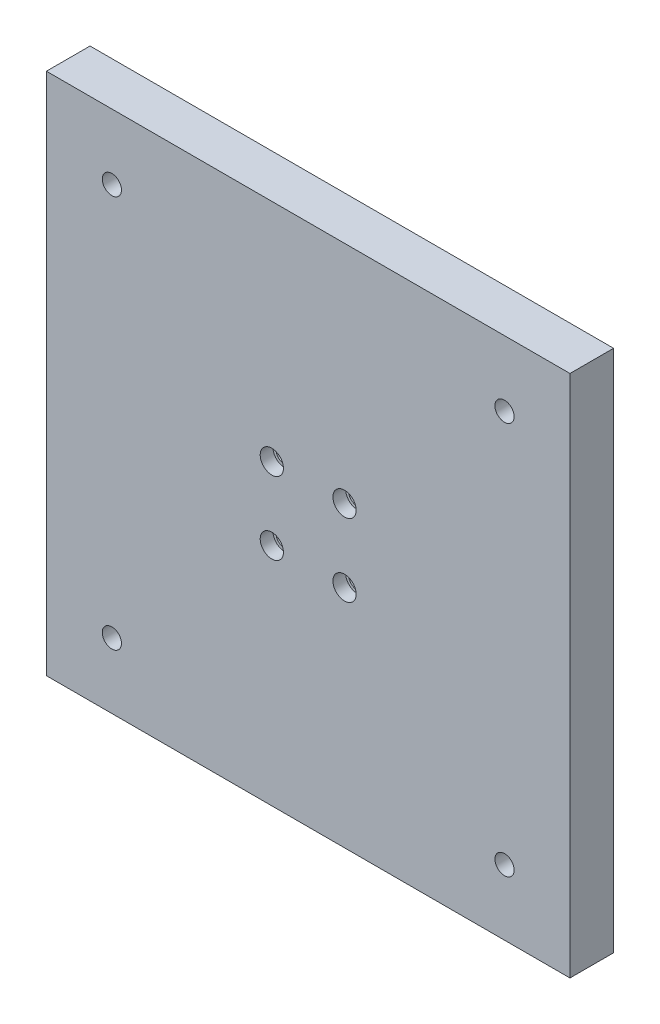
ISO-10303-21;
HEADER;
FILE_DESCRIPTION(('STEP AP214'),'2;1');
FILE_NAME('part.step','',(''),(''),'','','');
FILE_SCHEMA(('AUTOMOTIVE_DESIGN { 1 0 10303 214 1 1 1 1 }'));
ENDSEC;
DATA;
#1=APPLICATION_CONTEXT('core data for automotive mechanical design processes');
#2=APPLICATION_PROTOCOL_DEFINITION('international standard','automotive_design',2000,#1);
#3=PRODUCT_CONTEXT('',#1,'mechanical');
#4=PRODUCT('Part','Part','',(#3));
#5=PRODUCT_RELATED_PRODUCT_CATEGORY('part','',(#4));
#6=PRODUCT_DEFINITION_FORMATION('','',#4);
#7=PRODUCT_DEFINITION_CONTEXT('part definition',#1,'design');
#8=PRODUCT_DEFINITION('design','',#6,#7);
#9=PRODUCT_DEFINITION_SHAPE('','',#8);
#10=(LENGTH_UNIT() NAMED_UNIT(*) SI_UNIT(.MILLI.,.METRE.));
#11=(NAMED_UNIT(*) PLANE_ANGLE_UNIT() SI_UNIT($,.RADIAN.));
#12=(NAMED_UNIT(*) SI_UNIT($,.STERADIAN.) SOLID_ANGLE_UNIT());
#13=UNCERTAINTY_MEASURE_WITH_UNIT(LENGTH_MEASURE(1.E-05),#10,'distance_accuracy_value','');
#14=(GEOMETRIC_REPRESENTATION_CONTEXT(3) GLOBAL_UNCERTAINTY_ASSIGNED_CONTEXT((#13)) GLOBAL_UNIT_ASSIGNED_CONTEXT((#10,
#11,#12)) REPRESENTATION_CONTEXT('',''));
#15=CARTESIAN_POINT('',(0.,0.,0.));
#16=DIRECTION('',(0.,0.,1.));
#17=DIRECTION('',(1.,0.,0.));
#18=AXIS2_PLACEMENT_3D('',#15,#16,#17);
#19=CARTESIAN_POINT('',(0.,0.,15.));
#20=DIRECTION('',(0.,0.,1.));
#21=DIRECTION('',(1.,0.,0.));
#22=AXIS2_PLACEMENT_3D('',#19,#20,#21);
#23=PLANE('',#22);
#24=CARTESIAN_POINT('',(-157.5,22.5,15.));
#25=DIRECTION('',(0.,0.,-1.));
#26=DIRECTION('',(-1.,0.,0.));
#27=AXIS2_PLACEMENT_3D('',#24,#25,#26);
#28=CIRCLE('',#27,3.3);
#29=CARTESIAN_POINT('',(-160.8,22.5,15.));
#30=VERTEX_POINT('',#29);
#31=EDGE_CURVE('E527',#30,#30,#28,.T.);
#32=ORIENTED_EDGE('',*,*,#31,.T.);
#33=EDGE_LOOP('',(#32));
#34=FACE_BOUND('',#33,.T.);
#35=CARTESIAN_POINT('',(-22.5,22.5,15.));
#36=DIRECTION('',(0.,0.,-1.));
#37=DIRECTION('',(-1.,0.,0.));
#38=AXIS2_PLACEMENT_3D('',#35,#36,#37);
#39=CIRCLE('',#38,3.3);
#40=CARTESIAN_POINT('',(-25.8,22.5,15.));
#41=VERTEX_POINT('',#40);
#42=EDGE_CURVE('E515',#41,#41,#39,.T.);
#43=ORIENTED_EDGE('',*,*,#42,.T.);
#44=EDGE_LOOP('',(#43));
#45=FACE_BOUND('',#44,.T.);
#46=CARTESIAN_POINT('',(-22.5,157.5,15.));
#47=DIRECTION('',(0.,0.,-1.));
#48=DIRECTION('',(-1.,0.,0.));
#49=AXIS2_PLACEMENT_3D('',#46,#47,#48);
#50=CIRCLE('',#49,3.3);
#51=CARTESIAN_POINT('',(-25.8,157.5,15.));
#52=VERTEX_POINT('',#51);
#53=EDGE_CURVE('E503',#52,#52,#50,.T.);
#54=ORIENTED_EDGE('',*,*,#53,.T.);
#55=EDGE_LOOP('',(#54));
#56=FACE_BOUND('',#55,.T.);
#57=CARTESIAN_POINT('',(-157.5,157.5,15.));
#58=DIRECTION('',(0.,0.,-1.));
#59=DIRECTION('',(-1.,0.,0.));
#60=AXIS2_PLACEMENT_3D('',#57,#58,#59);
#61=CIRCLE('',#60,3.3);
#62=CARTESIAN_POINT('',(-160.8,157.5,15.));
#63=VERTEX_POINT('',#62);
#64=EDGE_CURVE('E489',#63,#63,#61,.T.);
#65=ORIENTED_EDGE('',*,*,#64,.T.);
#66=EDGE_LOOP('',(#65));
#67=FACE_BOUND('',#66,.T.);
#68=CARTESIAN_POINT('',(-102.5,77.5,15.));
#69=DIRECTION('',(0.,0.,1.));
#70=DIRECTION('',(1.,0.,0.));
#71=AXIS2_PLACEMENT_3D('',#68,#69,#70);
#72=CIRCLE('',#71,4.);
#73=CARTESIAN_POINT('',(-98.5,77.5,15.));
#74=VERTEX_POINT('',#73);
#75=EDGE_CURVE('E487',#74,#74,#72,.T.);
#76=ORIENTED_EDGE('',*,*,#75,.F.);
#77=EDGE_LOOP('',(#76));
#78=FACE_BOUND('',#77,.T.);
#79=CARTESIAN_POINT('',(-102.5,102.5,15.));
#80=DIRECTION('',(0.,0.,1.));
#81=DIRECTION('',(1.,0.,0.));
#82=AXIS2_PLACEMENT_3D('',#79,#80,#81);
#83=CIRCLE('',#82,4.);
#84=CARTESIAN_POINT('',(-98.5,102.5,15.));
#85=VERTEX_POINT('',#84);
#86=EDGE_CURVE('E137',#85,#85,#83,.T.);
#87=ORIENTED_EDGE('',*,*,#86,.F.);
#88=EDGE_LOOP('',(#87));
#89=FACE_BOUND('',#88,.T.);
#90=CARTESIAN_POINT('',(-77.5,102.5,15.));
#91=DIRECTION('',(0.,0.,1.));
#92=DIRECTION('',(1.,0.,0.));
#93=AXIS2_PLACEMENT_3D('',#90,#91,#92);
#94=CIRCLE('',#93,4.);
#95=CARTESIAN_POINT('',(-73.5,102.5,15.));
#96=VERTEX_POINT('',#95);
#97=EDGE_CURVE('E130',#96,#96,#94,.T.);
#98=ORIENTED_EDGE('',*,*,#97,.F.);
#99=EDGE_LOOP('',(#98));
#100=FACE_BOUND('',#99,.T.);
#101=CARTESIAN_POINT('',(-77.5,77.5,15.));
#102=DIRECTION('',(0.,0.,1.));
#103=DIRECTION('',(1.,0.,0.));
#104=AXIS2_PLACEMENT_3D('',#101,#102,#103);
#105=CIRCLE('',#104,4.);
#106=CARTESIAN_POINT('',(-73.5,77.5,15.));
#107=VERTEX_POINT('',#106);
#108=EDGE_CURVE('E126',#107,#107,#105,.T.);
#109=ORIENTED_EDGE('',*,*,#108,.F.);
#110=EDGE_LOOP('',(#109));
#111=FACE_BOUND('',#110,.T.);
#112=DIRECTION('',(0.,1.,0.));
#113=VECTOR('',#112,1.);
#114=CARTESIAN_POINT('',(0.,0.,15.));
#115=LINE('',#114,#113);
#116=CARTESIAN_POINT('',(0.,0.,15.));
#117=VERTEX_POINT('',#116);
#118=CARTESIAN_POINT('',(0.,180.,15.));
#119=VERTEX_POINT('',#118);
#120=EDGE_CURVE('E97',#117,#119,#115,.T.);
#121=ORIENTED_EDGE('',*,*,#120,.T.);
#122=DIRECTION('',(-1.,0.,0.));
#123=VECTOR('',#122,1.);
#124=CARTESIAN_POINT('',(0.,180.,15.));
#125=LINE('',#124,#123);
#126=CARTESIAN_POINT('',(-180.,180.,15.));
#127=VERTEX_POINT('',#126);
#128=EDGE_CURVE('E93',#119,#127,#125,.T.);
#129=ORIENTED_EDGE('',*,*,#128,.T.);
#130=DIRECTION('',(0.,-1.,0.));
#131=VECTOR('',#130,1.);
#132=CARTESIAN_POINT('',(-180.,0.,15.));
#133=LINE('',#132,#131);
#134=CARTESIAN_POINT('',(-180.,0.,15.));
#135=VERTEX_POINT('',#134);
#136=EDGE_CURVE('E95',#127,#135,#133,.T.);
#137=ORIENTED_EDGE('',*,*,#136,.T.);
#138=DIRECTION('',(1.,0.,0.));
#139=VECTOR('',#138,1.);
#140=CARTESIAN_POINT('',(0.,0.,15.));
#141=LINE('',#140,#139);
#142=EDGE_CURVE('E63',#135,#117,#141,.T.);
#143=ORIENTED_EDGE('',*,*,#142,.T.);
#144=EDGE_LOOP('',(#121,#129,#137,#143));
#145=FACE_BOUND('',#144,.T.);
#146=ADVANCED_FACE('F44',(#34,#45,#56,#67,#78,#89,#100,#111,#145),#23,.T.);
#147=CARTESIAN_POINT('',(0.,0.,0.));
#148=DIRECTION('',(0.,0.,1.));
#149=DIRECTION('',(1.,0.,0.));
#150=AXIS2_PLACEMENT_3D('',#147,#148,#149);
#151=PLANE('',#150);
#152=CARTESIAN_POINT('',(-157.5,22.5,0.));
#153=DIRECTION('',(0.,0.,-1.));
#154=DIRECTION('',(-1.,0.,0.));
#155=AXIS2_PLACEMENT_3D('',#152,#153,#154);
#156=CIRCLE('',#155,5.50000000000001);
#157=CARTESIAN_POINT('',(-163.,22.5,0.));
#158=VERTEX_POINT('',#157);
#159=EDGE_CURVE('E535',#158,#158,#156,.T.);
#160=ORIENTED_EDGE('',*,*,#159,.F.);
#161=EDGE_LOOP('',(#160));
#162=FACE_BOUND('',#161,.T.);
#163=CARTESIAN_POINT('',(-22.5,22.5,0.));
#164=DIRECTION('',(0.,0.,-1.));
#165=DIRECTION('',(-1.,0.,0.));
#166=AXIS2_PLACEMENT_3D('',#163,#164,#165);
#167=CIRCLE('',#166,5.5);
#168=CARTESIAN_POINT('',(-28.,22.5,0.));
#169=VERTEX_POINT('',#168);
#170=EDGE_CURVE('E524',#169,#169,#167,.T.);
#171=ORIENTED_EDGE('',*,*,#170,.F.);
#172=EDGE_LOOP('',(#171));
#173=FACE_BOUND('',#172,.T.);
#174=CARTESIAN_POINT('',(-22.5,157.5,0.));
#175=DIRECTION('',(0.,0.,-1.));
#176=DIRECTION('',(-1.,0.,0.));
#177=AXIS2_PLACEMENT_3D('',#174,#175,#176);
#178=CIRCLE('',#177,5.5);
#179=CARTESIAN_POINT('',(-28.,157.5,0.));
#180=VERTEX_POINT('',#179);
#181=EDGE_CURVE('E512',#180,#180,#178,.T.);
#182=ORIENTED_EDGE('',*,*,#181,.F.);
#183=EDGE_LOOP('',(#182));
#184=FACE_BOUND('',#183,.T.);
#185=CARTESIAN_POINT('',(-157.5,157.5,0.));
#186=DIRECTION('',(0.,0.,-1.));
#187=DIRECTION('',(-1.,0.,0.));
#188=AXIS2_PLACEMENT_3D('',#185,#186,#187);
#189=CIRCLE('',#188,5.50000000000001);
#190=CARTESIAN_POINT('',(-163.,157.5,0.));
#191=VERTEX_POINT('',#190);
#192=EDGE_CURVE('E500',#191,#191,#189,.T.);
#193=ORIENTED_EDGE('',*,*,#192,.F.);
#194=EDGE_LOOP('',(#193));
#195=FACE_BOUND('',#194,.T.);
#196=CARTESIAN_POINT('',(-102.5,102.5,0.));
#197=DIRECTION('',(0.,0.,1.));
#198=DIRECTION('',(1.,0.,0.));
#199=AXIS2_PLACEMENT_3D('',#196,#197,#198);
#200=CIRCLE('',#199,3.00000000000001);
#201=CARTESIAN_POINT('',(-99.5,102.5,0.));
#202=VERTEX_POINT('',#201);
#203=EDGE_CURVE('E122',#202,#202,#200,.T.);
#204=ORIENTED_EDGE('',*,*,#203,.T.);
#205=EDGE_LOOP('',(#204));
#206=FACE_BOUND('',#205,.T.);
#207=CARTESIAN_POINT('',(-77.5,102.5,0.));
#208=DIRECTION('',(0.,0.,1.));
#209=DIRECTION('',(1.,0.,0.));
#210=AXIS2_PLACEMENT_3D('',#207,#208,#209);
#211=CIRCLE('',#210,3.00000000000001);
#212=CARTESIAN_POINT('',(-74.5,102.5,0.));
#213=VERTEX_POINT('',#212);
#214=EDGE_CURVE('E153',#213,#213,#211,.T.);
#215=ORIENTED_EDGE('',*,*,#214,.T.);
#216=EDGE_LOOP('',(#215));
#217=FACE_BOUND('',#216,.T.);
#218=CARTESIAN_POINT('',(-77.5,77.5,0.));
#219=DIRECTION('',(0.,0.,1.));
#220=DIRECTION('',(1.,0.,0.));
#221=AXIS2_PLACEMENT_3D('',#218,#219,#220);
#222=CIRCLE('',#221,3.00000000000001);
#223=CARTESIAN_POINT('',(-74.5,77.5,0.));
#224=VERTEX_POINT('',#223);
#225=EDGE_CURVE('E156',#224,#224,#222,.T.);
#226=ORIENTED_EDGE('',*,*,#225,.T.);
#227=EDGE_LOOP('',(#226));
#228=FACE_BOUND('',#227,.T.);
#229=CARTESIAN_POINT('',(-102.5,77.5,0.));
#230=DIRECTION('',(0.,0.,1.));
#231=DIRECTION('',(1.,0.,0.));
#232=AXIS2_PLACEMENT_3D('',#229,#230,#231);
#233=CIRCLE('',#232,3.00000000000001);
#234=CARTESIAN_POINT('',(-99.5,77.5,0.));
#235=VERTEX_POINT('',#234);
#236=EDGE_CURVE('E113',#235,#235,#233,.T.);
#237=ORIENTED_EDGE('',*,*,#236,.T.);
#238=EDGE_LOOP('',(#237));
#239=FACE_BOUND('',#238,.T.);
#240=DIRECTION('',(0.,1.,0.));
#241=VECTOR('',#240,1.);
#242=CARTESIAN_POINT('',(0.,0.,0.));
#243=LINE('',#242,#241);
#244=CARTESIAN_POINT('',(0.,0.,0.));
#245=VERTEX_POINT('',#244);
#246=CARTESIAN_POINT('',(0.,180.,0.));
#247=VERTEX_POINT('',#246);
#248=EDGE_CURVE('E110',#245,#247,#243,.T.);
#249=ORIENTED_EDGE('',*,*,#248,.F.);
#250=DIRECTION('',(1.,0.,0.));
#251=VECTOR('',#250,1.);
#252=CARTESIAN_POINT('',(0.,0.,0.));
#253=LINE('',#252,#251);
#254=CARTESIAN_POINT('',(-180.,0.,0.));
#255=VERTEX_POINT('',#254);
#256=EDGE_CURVE('E86',#255,#245,#253,.T.);
#257=ORIENTED_EDGE('',*,*,#256,.F.);
#258=DIRECTION('',(0.,-1.,0.));
#259=VECTOR('',#258,1.);
#260=CARTESIAN_POINT('',(-180.,0.,0.));
#261=LINE('',#260,#259);
#262=CARTESIAN_POINT('',(-180.,180.,0.));
#263=VERTEX_POINT('',#262);
#264=EDGE_CURVE('E80',#263,#255,#261,.T.);
#265=ORIENTED_EDGE('',*,*,#264,.F.);
#266=DIRECTION('',(-1.,0.,0.));
#267=VECTOR('',#266,1.);
#268=CARTESIAN_POINT('',(0.,180.,0.));
#269=LINE('',#268,#267);
#270=EDGE_CURVE('E101',#247,#263,#269,.T.);
#271=ORIENTED_EDGE('',*,*,#270,.F.);
#272=EDGE_LOOP('',(#249,#257,#265,#271));
#273=FACE_BOUND('',#272,.T.);
#274=ADVANCED_FACE('F162',(#162,#173,#184,#195,#206,#217,#228,#239,#273),#151,.F.);
#275=CARTESIAN_POINT('',(0.,0.,15.));
#276=DIRECTION('',(-1.,0.,0.));
#277=DIRECTION('',(0.,0.,1.));
#278=AXIS2_PLACEMENT_3D('',#275,#276,#277);
#279=PLANE('',#278);
#280=ORIENTED_EDGE('',*,*,#248,.T.);
#281=DIRECTION('',(0.,0.,-1.));
#282=VECTOR('',#281,1.);
#283=CARTESIAN_POINT('',(0.,180.,15.));
#284=LINE('',#283,#282);
#285=EDGE_CURVE('E13',#119,#247,#284,.T.);
#286=ORIENTED_EDGE('',*,*,#285,.F.);
#287=ORIENTED_EDGE('',*,*,#120,.F.);
#288=DIRECTION('',(0.,0.,-1.));
#289=VECTOR('',#288,1.);
#290=CARTESIAN_POINT('',(0.,0.,15.));
#291=LINE('',#290,#289);
#292=EDGE_CURVE('E106',#117,#245,#291,.T.);
#293=ORIENTED_EDGE('',*,*,#292,.T.);
#294=EDGE_LOOP('',(#280,#286,#287,#293));
#295=FACE_BOUND('',#294,.T.);
#296=ADVANCED_FACE('F46',(#295),#279,.F.);
#297=CARTESIAN_POINT('',(0.,180.,15.));
#298=DIRECTION('',(0.,-1.,0.));
#299=DIRECTION('',(0.,0.,-1.));
#300=AXIS2_PLACEMENT_3D('',#297,#298,#299);
#301=PLANE('',#300);
#302=ORIENTED_EDGE('',*,*,#270,.T.);
#303=DIRECTION('',(0.,0.,-1.));
#304=VECTOR('',#303,1.);
#305=CARTESIAN_POINT('',(-180.,180.,15.));
#306=LINE('',#305,#304);
#307=EDGE_CURVE('E54',#127,#263,#306,.T.);
#308=ORIENTED_EDGE('',*,*,#307,.F.);
#309=ORIENTED_EDGE('',*,*,#128,.F.);
#310=ORIENTED_EDGE('',*,*,#285,.T.);
#311=EDGE_LOOP('',(#302,#308,#309,#310));
#312=FACE_BOUND('',#311,.T.);
#313=ADVANCED_FACE('F100',(#312),#301,.F.);
#314=CARTESIAN_POINT('',(-180.,0.,15.));
#315=DIRECTION('',(1.,0.,0.));
#316=DIRECTION('',(0.,0.,-1.));
#317=AXIS2_PLACEMENT_3D('',#314,#315,#316);
#318=PLANE('',#317);
#319=ORIENTED_EDGE('',*,*,#264,.T.);
#320=DIRECTION('',(0.,0.,-1.));
#321=VECTOR('',#320,1.);
#322=CARTESIAN_POINT('',(-180.,0.,15.));
#323=LINE('',#322,#321);
#324=EDGE_CURVE('E102',#135,#255,#323,.T.);
#325=ORIENTED_EDGE('',*,*,#324,.F.);
#326=ORIENTED_EDGE('',*,*,#136,.F.);
#327=ORIENTED_EDGE('',*,*,#307,.T.);
#328=EDGE_LOOP('',(#319,#325,#326,#327));
#329=FACE_BOUND('',#328,.T.);
#330=ADVANCED_FACE('F104',(#329),#318,.F.);
#331=CARTESIAN_POINT('',(0.,0.,15.));
#332=DIRECTION('',(0.,1.,0.));
#333=DIRECTION('',(-1.,0.,0.));
#334=AXIS2_PLACEMENT_3D('',#331,#332,#333);
#335=PLANE('',#334);
#336=ORIENTED_EDGE('',*,*,#256,.T.);
#337=ORIENTED_EDGE('',*,*,#292,.F.);
#338=ORIENTED_EDGE('',*,*,#142,.F.);
#339=ORIENTED_EDGE('',*,*,#324,.T.);
#340=EDGE_LOOP('',(#336,#337,#338,#339));
#341=FACE_BOUND('',#340,.T.);
#342=ADVANCED_FACE('F168',(#341),#335,.F.);
#343=CARTESIAN_POINT('',(-102.5,77.5,0.));
#344=DIRECTION('',(0.,0.,1.));
#345=DIRECTION('',(1.,0.,0.));
#346=AXIS2_PLACEMENT_3D('',#343,#344,#345);
#347=CYLINDRICAL_SURFACE('',#346,3.00000000000001);
#348=CARTESIAN_POINT('',(-102.5,77.5,10.6));
#349=DIRECTION('',(0.,0.,-1.));
#350=DIRECTION('',(-1.,0.,0.));
#351=AXIS2_PLACEMENT_3D('',#348,#349,#350);
#352=CIRCLE('',#351,3.00000000000001);
#353=CARTESIAN_POINT('',(-105.5,77.5,10.6));
#354=VERTEX_POINT('',#353);
#355=EDGE_CURVE('E48',#354,#354,#352,.F.);
#356=ORIENTED_EDGE('',*,*,#355,.T.);
#357=EDGE_LOOP('',(#356));
#358=FACE_BOUND('',#357,.T.);
#359=ORIENTED_EDGE('',*,*,#236,.F.);
#360=EDGE_LOOP('',(#359));
#361=FACE_BOUND('',#360,.T.);
#362=ADVANCED_FACE('F165',(#358,#361),#347,.F.);
#363=CARTESIAN_POINT('',(-77.5,77.5,0.));
#364=DIRECTION('',(0.,0.,1.));
#365=DIRECTION('',(1.,0.,0.));
#366=AXIS2_PLACEMENT_3D('',#363,#364,#365);
#367=CYLINDRICAL_SURFACE('',#366,3.00000000000001);
#368=CARTESIAN_POINT('',(-77.5,77.5,10.6));
#369=DIRECTION('',(0.,0.,-1.));
#370=DIRECTION('',(-1.,0.,0.));
#371=AXIS2_PLACEMENT_3D('',#368,#369,#370);
#372=CIRCLE('',#371,3.00000000000001);
#373=CARTESIAN_POINT('',(-80.5,77.5,10.6));
#374=VERTEX_POINT('',#373);
#375=EDGE_CURVE('E119',#374,#374,#372,.F.);
#376=ORIENTED_EDGE('',*,*,#375,.T.);
#377=EDGE_LOOP('',(#376));
#378=FACE_BOUND('',#377,.T.);
#379=ORIENTED_EDGE('',*,*,#225,.F.);
#380=EDGE_LOOP('',(#379));
#381=FACE_BOUND('',#380,.T.);
#382=ADVANCED_FACE('F167',(#378,#381),#367,.F.);
#383=CARTESIAN_POINT('',(-77.5,102.5,0.));
#384=DIRECTION('',(0.,0.,1.));
#385=DIRECTION('',(1.,0.,0.));
#386=AXIS2_PLACEMENT_3D('',#383,#384,#385);
#387=CYLINDRICAL_SURFACE('',#386,3.00000000000001);
#388=CARTESIAN_POINT('',(-77.5,102.5,10.6));
#389=DIRECTION('',(0.,0.,-1.));
#390=DIRECTION('',(-1.,0.,0.));
#391=AXIS2_PLACEMENT_3D('',#388,#389,#390);
#392=CIRCLE('',#391,3.00000000000001);
#393=CARTESIAN_POINT('',(-80.5,102.5,10.6));
#394=VERTEX_POINT('',#393);
#395=EDGE_CURVE('E124',#394,#394,#392,.F.);
#396=ORIENTED_EDGE('',*,*,#395,.T.);
#397=EDGE_LOOP('',(#396));
#398=FACE_BOUND('',#397,.T.);
#399=ORIENTED_EDGE('',*,*,#214,.F.);
#400=EDGE_LOOP('',(#399));
#401=FACE_BOUND('',#400,.T.);
#402=ADVANCED_FACE('F175',(#398,#401),#387,.F.);
#403=CARTESIAN_POINT('',(-102.5,102.5,0.));
#404=DIRECTION('',(0.,0.,1.));
#405=DIRECTION('',(1.,0.,0.));
#406=AXIS2_PLACEMENT_3D('',#403,#404,#405);
#407=CYLINDRICAL_SURFACE('',#406,3.00000000000001);
#408=CARTESIAN_POINT('',(-102.5,102.5,10.6));
#409=DIRECTION('',(0.,0.,-1.));
#410=DIRECTION('',(-1.,0.,0.));
#411=AXIS2_PLACEMENT_3D('',#408,#409,#410);
#412=CIRCLE('',#411,3.00000000000001);
#413=CARTESIAN_POINT('',(-105.5,102.5,10.6));
#414=VERTEX_POINT('',#413);
#415=EDGE_CURVE('E128',#414,#414,#412,.F.);
#416=ORIENTED_EDGE('',*,*,#415,.T.);
#417=EDGE_LOOP('',(#416));
#418=FACE_BOUND('',#417,.T.);
#419=ORIENTED_EDGE('',*,*,#203,.F.);
#420=EDGE_LOOP('',(#419));
#421=FACE_BOUND('',#420,.T.);
#422=ADVANCED_FACE('F365',(#418,#421),#407,.F.);
#423=CARTESIAN_POINT('',(-75.25,77.5,10.6));
#424=DIRECTION('',(0.,0.,-1.));
#425=DIRECTION('',(-1.,0.,0.));
#426=AXIS2_PLACEMENT_3D('',#423,#424,#425);
#427=PLANE('',#426);
#428=CARTESIAN_POINT('',(-77.5,77.5,10.6));
#429=DIRECTION('',(0.,0.,1.));
#430=DIRECTION('',(1.,0.,0.));
#431=AXIS2_PLACEMENT_3D('',#428,#429,#430);
#432=CIRCLE('',#431,4.);
#433=CARTESIAN_POINT('',(-73.5,77.5,10.6));
#434=VERTEX_POINT('',#433);
#435=EDGE_CURVE('E123',#434,#434,#432,.T.);
#436=ORIENTED_EDGE('',*,*,#435,.T.);
#437=EDGE_LOOP('',(#436));
#438=FACE_BOUND('',#437,.T.);
#439=ORIENTED_EDGE('',*,*,#375,.F.);
#440=EDGE_LOOP('',(#439));
#441=FACE_BOUND('',#440,.T.);
#442=ADVANCED_FACE('F361',(#438,#441),#427,.F.);
#443=CARTESIAN_POINT('',(-77.5,77.5,15.));
#444=DIRECTION('',(0.,0.,1.));
#445=DIRECTION('',(1.,0.,0.));
#446=AXIS2_PLACEMENT_3D('',#443,#444,#445);
#447=CYLINDRICAL_SURFACE('',#446,4.);
#448=ORIENTED_EDGE('',*,*,#435,.F.);
#449=EDGE_LOOP('',(#448));
#450=FACE_BOUND('',#449,.T.);
#451=ORIENTED_EDGE('',*,*,#108,.T.);
#452=EDGE_LOOP('',(#451));
#453=FACE_BOUND('',#452,.T.);
#454=ADVANCED_FACE('F357',(#450,#453),#447,.F.);
#455=CARTESIAN_POINT('',(-75.25,102.5,10.6));
#456=DIRECTION('',(0.,0.,-1.));
#457=DIRECTION('',(-1.,0.,0.));
#458=AXIS2_PLACEMENT_3D('',#455,#456,#457);
#459=PLANE('',#458);
#460=CARTESIAN_POINT('',(-77.5,102.5,10.6));
#461=DIRECTION('',(0.,0.,1.));
#462=DIRECTION('',(1.,0.,0.));
#463=AXIS2_PLACEMENT_3D('',#460,#461,#462);
#464=CIRCLE('',#463,4.);
#465=CARTESIAN_POINT('',(-73.5,102.5,10.6));
#466=VERTEX_POINT('',#465);
#467=EDGE_CURVE('E127',#466,#466,#464,.T.);
#468=ORIENTED_EDGE('',*,*,#467,.T.);
#469=EDGE_LOOP('',(#468));
#470=FACE_BOUND('',#469,.T.);
#471=ORIENTED_EDGE('',*,*,#395,.F.);
#472=EDGE_LOOP('',(#471));
#473=FACE_BOUND('',#472,.T.);
#474=ADVANCED_FACE('F353',(#470,#473),#459,.F.);
#475=CARTESIAN_POINT('',(-77.5,102.5,15.));
#476=DIRECTION('',(0.,0.,1.));
#477=DIRECTION('',(1.,0.,0.));
#478=AXIS2_PLACEMENT_3D('',#475,#476,#477);
#479=CYLINDRICAL_SURFACE('',#478,4.);
#480=ORIENTED_EDGE('',*,*,#467,.F.);
#481=EDGE_LOOP('',(#480));
#482=FACE_BOUND('',#481,.T.);
#483=ORIENTED_EDGE('',*,*,#97,.T.);
#484=EDGE_LOOP('',(#483));
#485=FACE_BOUND('',#484,.T.);
#486=ADVANCED_FACE('F350',(#482,#485),#479,.F.);
#487=CARTESIAN_POINT('',(-100.25,102.5,10.6));
#488=DIRECTION('',(0.,0.,-1.));
#489=DIRECTION('',(-1.,0.,0.));
#490=AXIS2_PLACEMENT_3D('',#487,#488,#489);
#491=PLANE('',#490);
#492=CARTESIAN_POINT('',(-102.5,102.5,10.6));
#493=DIRECTION('',(0.,0.,1.));
#494=DIRECTION('',(1.,0.,0.));
#495=AXIS2_PLACEMENT_3D('',#492,#493,#494);
#496=CIRCLE('',#495,4.);
#497=CARTESIAN_POINT('',(-98.5,102.5,10.6));
#498=VERTEX_POINT('',#497);
#499=EDGE_CURVE('E131',#498,#498,#496,.T.);
#500=ORIENTED_EDGE('',*,*,#499,.T.);
#501=EDGE_LOOP('',(#500));
#502=FACE_BOUND('',#501,.T.);
#503=ORIENTED_EDGE('',*,*,#415,.F.);
#504=EDGE_LOOP('',(#503));
#505=FACE_BOUND('',#504,.T.);
#506=ADVANCED_FACE('F346',(#502,#505),#491,.F.);
#507=CARTESIAN_POINT('',(-102.5,102.5,15.));
#508=DIRECTION('',(0.,0.,1.));
#509=DIRECTION('',(1.,0.,0.));
#510=AXIS2_PLACEMENT_3D('',#507,#508,#509);
#511=CYLINDRICAL_SURFACE('',#510,4.);
#512=ORIENTED_EDGE('',*,*,#499,.F.);
#513=EDGE_LOOP('',(#512));
#514=FACE_BOUND('',#513,.T.);
#515=ORIENTED_EDGE('',*,*,#86,.T.);
#516=EDGE_LOOP('',(#515));
#517=FACE_BOUND('',#516,.T.);
#518=ADVANCED_FACE('F342',(#514,#517),#511,.F.);
#519=CARTESIAN_POINT('',(-100.25,77.5,10.6));
#520=DIRECTION('',(0.,0.,-1.));
#521=DIRECTION('',(-1.,0.,0.));
#522=AXIS2_PLACEMENT_3D('',#519,#520,#521);
#523=PLANE('',#522);
#524=CARTESIAN_POINT('',(-102.5,77.5,10.6));
#525=DIRECTION('',(0.,0.,1.));
#526=DIRECTION('',(1.,0.,0.));
#527=AXIS2_PLACEMENT_3D('',#524,#525,#526);
#528=CIRCLE('',#527,4.);
#529=CARTESIAN_POINT('',(-98.5,77.5,10.6));
#530=VERTEX_POINT('',#529);
#531=EDGE_CURVE('E485',#530,#530,#528,.T.);
#532=ORIENTED_EDGE('',*,*,#531,.T.);
#533=EDGE_LOOP('',(#532));
#534=FACE_BOUND('',#533,.T.);
#535=ORIENTED_EDGE('',*,*,#355,.F.);
#536=EDGE_LOOP('',(#535));
#537=FACE_BOUND('',#536,.T.);
#538=ADVANCED_FACE('F338',(#534,#537),#523,.F.);
#539=CARTESIAN_POINT('',(-102.5,77.5,15.));
#540=DIRECTION('',(0.,0.,1.));
#541=DIRECTION('',(1.,0.,0.));
#542=AXIS2_PLACEMENT_3D('',#539,#540,#541);
#543=CYLINDRICAL_SURFACE('',#542,4.);
#544=ORIENTED_EDGE('',*,*,#531,.F.);
#545=EDGE_LOOP('',(#544));
#546=FACE_BOUND('',#545,.T.);
#547=ORIENTED_EDGE('',*,*,#75,.T.);
#548=EDGE_LOOP('',(#547));
#549=FACE_BOUND('',#548,.T.);
#550=ADVANCED_FACE('F218',(#546,#549),#543,.F.);
#551=CARTESIAN_POINT('',(-157.5,157.5,0.));
#552=DIRECTION('',(0.,0.,-1.));
#553=DIRECTION('',(-1.,0.,0.));
#554=AXIS2_PLACEMENT_3D('',#551,#552,#553);
#555=CYLINDRICAL_SURFACE('',#554,3.3);
#556=ORIENTED_EDGE('',*,*,#64,.F.);
#557=EDGE_LOOP('',(#556));
#558=FACE_BOUND('',#557,.T.);
#559=CARTESIAN_POINT('',(-157.5,157.5,6.4));
#560=DIRECTION('',(0.,0.,-1.));
#561=DIRECTION('',(-1.,0.,0.));
#562=AXIS2_PLACEMENT_3D('',#559,#560,#561);
#563=CIRCLE('',#562,3.3);
#564=CARTESIAN_POINT('',(-160.8,157.5,6.4));
#565=VERTEX_POINT('',#564);
#566=EDGE_CURVE('E494',#565,#565,#563,.T.);
#567=ORIENTED_EDGE('',*,*,#566,.T.);
#568=EDGE_LOOP('',(#567));
#569=FACE_BOUND('',#568,.T.);
#570=ADVANCED_FACE('F212',(#558,#569),#555,.F.);
#571=CARTESIAN_POINT('',(-154.2,157.5,6.4));
#572=DIRECTION('',(0.,0.,1.));
#573=DIRECTION('',(1.,0.,0.));
#574=AXIS2_PLACEMENT_3D('',#571,#572,#573);
#575=PLANE('',#574);
#576=ORIENTED_EDGE('',*,*,#566,.F.);
#577=EDGE_LOOP('',(#576));
#578=FACE_BOUND('',#577,.T.);
#579=CARTESIAN_POINT('',(-157.5,157.5,6.4));
#580=DIRECTION('',(0.,0.,-1.));
#581=DIRECTION('',(-1.,0.,0.));
#582=AXIS2_PLACEMENT_3D('',#579,#580,#581);
#583=CIRCLE('',#582,5.50000000000001);
#584=CARTESIAN_POINT('',(-163.,157.5,6.4));
#585=VERTEX_POINT('',#584);
#586=EDGE_CURVE('E497',#585,#585,#583,.T.);
#587=ORIENTED_EDGE('',*,*,#586,.T.);
#588=EDGE_LOOP('',(#587));
#589=FACE_BOUND('',#588,.T.);
#590=ADVANCED_FACE('F217',(#578,#589),#575,.F.);
#591=CARTESIAN_POINT('',(-157.5,157.5,0.));
#592=DIRECTION('',(0.,0.,-1.));
#593=DIRECTION('',(-1.,0.,0.));
#594=AXIS2_PLACEMENT_3D('',#591,#592,#593);
#595=CYLINDRICAL_SURFACE('',#594,5.50000000000001);
#596=ORIENTED_EDGE('',*,*,#586,.F.);
#597=EDGE_LOOP('',(#596));
#598=FACE_BOUND('',#597,.T.);
#599=ORIENTED_EDGE('',*,*,#192,.T.);
#600=EDGE_LOOP('',(#599));
#601=FACE_BOUND('',#600,.T.);
#602=ADVANCED_FACE('F230',(#598,#601),#595,.F.);
#603=CARTESIAN_POINT('',(-22.5,157.5,0.));
#604=DIRECTION('',(0.,0.,-1.));
#605=DIRECTION('',(-1.,0.,0.));
#606=AXIS2_PLACEMENT_3D('',#603,#604,#605);
#607=CYLINDRICAL_SURFACE('',#606,3.3);
#608=ORIENTED_EDGE('',*,*,#53,.F.);
#609=EDGE_LOOP('',(#608));
#610=FACE_BOUND('',#609,.T.);
#611=CARTESIAN_POINT('',(-22.5,157.5,6.4));
#612=DIRECTION('',(0.,0.,-1.));
#613=DIRECTION('',(-1.,0.,0.));
#614=AXIS2_PLACEMENT_3D('',#611,#612,#613);
#615=CIRCLE('',#614,3.3);
#616=CARTESIAN_POINT('',(-25.8,157.5,6.4));
#617=VERTEX_POINT('',#616);
#618=EDGE_CURVE('E506',#617,#617,#615,.T.);
#619=ORIENTED_EDGE('',*,*,#618,.T.);
#620=EDGE_LOOP('',(#619));
#621=FACE_BOUND('',#620,.T.);
#622=ADVANCED_FACE('F240',(#610,#621),#607,.F.);
#623=CARTESIAN_POINT('',(-19.2,157.5,6.4));
#624=DIRECTION('',(0.,0.,1.));
#625=DIRECTION('',(1.,0.,0.));
#626=AXIS2_PLACEMENT_3D('',#623,#624,#625);
#627=PLANE('',#626);
#628=ORIENTED_EDGE('',*,*,#618,.F.);
#629=EDGE_LOOP('',(#628));
#630=FACE_BOUND('',#629,.T.);
#631=CARTESIAN_POINT('',(-22.5,157.5,6.4));
#632=DIRECTION('',(0.,0.,-1.));
#633=DIRECTION('',(-1.,0.,0.));
#634=AXIS2_PLACEMENT_3D('',#631,#632,#633);
#635=CIRCLE('',#634,5.5);
#636=CARTESIAN_POINT('',(-28.,157.5,6.4));
#637=VERTEX_POINT('',#636);
#638=EDGE_CURVE('E509',#637,#637,#635,.T.);
#639=ORIENTED_EDGE('',*,*,#638,.T.);
#640=EDGE_LOOP('',(#639));
#641=FACE_BOUND('',#640,.T.);
#642=ADVANCED_FACE('F250',(#630,#641),#627,.F.);
#643=CARTESIAN_POINT('',(-22.5,157.5,0.));
#644=DIRECTION('',(0.,0.,-1.));
#645=DIRECTION('',(-1.,0.,0.));
#646=AXIS2_PLACEMENT_3D('',#643,#644,#645);
#647=CYLINDRICAL_SURFACE('',#646,5.5);
#648=ORIENTED_EDGE('',*,*,#638,.F.);
#649=EDGE_LOOP('',(#648));
#650=FACE_BOUND('',#649,.T.);
#651=ORIENTED_EDGE('',*,*,#181,.T.);
#652=EDGE_LOOP('',(#651));
#653=FACE_BOUND('',#652,.T.);
#654=ADVANCED_FACE('F260',(#650,#653),#647,.F.);
#655=CARTESIAN_POINT('',(-22.5,22.5,0.));
#656=DIRECTION('',(0.,0.,-1.));
#657=DIRECTION('',(-1.,0.,0.));
#658=AXIS2_PLACEMENT_3D('',#655,#656,#657);
#659=CYLINDRICAL_SURFACE('',#658,3.3);
#660=ORIENTED_EDGE('',*,*,#42,.F.);
#661=EDGE_LOOP('',(#660));
#662=FACE_BOUND('',#661,.T.);
#663=CARTESIAN_POINT('',(-22.5,22.5,6.4));
#664=DIRECTION('',(0.,0.,-1.));
#665=DIRECTION('',(-1.,0.,0.));
#666=AXIS2_PLACEMENT_3D('',#663,#664,#665);
#667=CIRCLE('',#666,3.3);
#668=CARTESIAN_POINT('',(-25.8,22.5,6.4));
#669=VERTEX_POINT('',#668);
#670=EDGE_CURVE('E518',#669,#669,#667,.T.);
#671=ORIENTED_EDGE('',*,*,#670,.T.);
#672=EDGE_LOOP('',(#671));
#673=FACE_BOUND('',#672,.T.);
#674=ADVANCED_FACE('F270',(#662,#673),#659,.F.);
#675=CARTESIAN_POINT('',(-19.2,22.5,6.4));
#676=DIRECTION('',(0.,0.,1.));
#677=DIRECTION('',(1.,0.,0.));
#678=AXIS2_PLACEMENT_3D('',#675,#676,#677);
#679=PLANE('',#678);
#680=ORIENTED_EDGE('',*,*,#670,.F.);
#681=EDGE_LOOP('',(#680));
#682=FACE_BOUND('',#681,.T.);
#683=CARTESIAN_POINT('',(-22.5,22.5,6.4));
#684=DIRECTION('',(0.,0.,-1.));
#685=DIRECTION('',(-1.,0.,0.));
#686=AXIS2_PLACEMENT_3D('',#683,#684,#685);
#687=CIRCLE('',#686,5.5);
#688=CARTESIAN_POINT('',(-28.,22.5,6.4));
#689=VERTEX_POINT('',#688);
#690=EDGE_CURVE('E521',#689,#689,#687,.T.);
#691=ORIENTED_EDGE('',*,*,#690,.T.);
#692=EDGE_LOOP('',(#691));
#693=FACE_BOUND('',#692,.T.);
#694=ADVANCED_FACE('F280',(#682,#693),#679,.F.);
#695=CARTESIAN_POINT('',(-22.5,22.5,0.));
#696=DIRECTION('',(0.,0.,-1.));
#697=DIRECTION('',(-1.,0.,0.));
#698=AXIS2_PLACEMENT_3D('',#695,#696,#697);
#699=CYLINDRICAL_SURFACE('',#698,5.5);
#700=ORIENTED_EDGE('',*,*,#690,.F.);
#701=EDGE_LOOP('',(#700));
#702=FACE_BOUND('',#701,.T.);
#703=ORIENTED_EDGE('',*,*,#170,.T.);
#704=EDGE_LOOP('',(#703));
#705=FACE_BOUND('',#704,.T.);
#706=ADVANCED_FACE('F290',(#702,#705),#699,.F.);
#707=CARTESIAN_POINT('',(-157.5,22.5,0.));
#708=DIRECTION('',(0.,0.,-1.));
#709=DIRECTION('',(-1.,0.,0.));
#710=AXIS2_PLACEMENT_3D('',#707,#708,#709);
#711=CYLINDRICAL_SURFACE('',#710,3.3);
#712=ORIENTED_EDGE('',*,*,#31,.F.);
#713=EDGE_LOOP('',(#712));
#714=FACE_BOUND('',#713,.T.);
#715=CARTESIAN_POINT('',(-157.5,22.5,6.4));
#716=DIRECTION('',(0.,0.,-1.));
#717=DIRECTION('',(-1.,0.,0.));
#718=AXIS2_PLACEMENT_3D('',#715,#716,#717);
#719=CIRCLE('',#718,3.3);
#720=CARTESIAN_POINT('',(-160.8,22.5,6.4));
#721=VERTEX_POINT('',#720);
#722=EDGE_CURVE('E529',#721,#721,#719,.T.);
#723=ORIENTED_EDGE('',*,*,#722,.T.);
#724=EDGE_LOOP('',(#723));
#725=FACE_BOUND('',#724,.T.);
#726=ADVANCED_FACE('F300',(#714,#725),#711,.F.);
#727=CARTESIAN_POINT('',(-154.2,22.5,6.4));
#728=DIRECTION('',(0.,0.,1.));
#729=DIRECTION('',(1.,0.,0.));
#730=AXIS2_PLACEMENT_3D('',#727,#728,#729);
#731=PLANE('',#730);
#732=ORIENTED_EDGE('',*,*,#722,.F.);
#733=EDGE_LOOP('',(#732));
#734=FACE_BOUND('',#733,.T.);
#735=CARTESIAN_POINT('',(-157.5,22.5,6.4));
#736=DIRECTION('',(0.,0.,-1.));
#737=DIRECTION('',(-1.,0.,0.));
#738=AXIS2_PLACEMENT_3D('',#735,#736,#737);
#739=CIRCLE('',#738,5.50000000000001);
#740=CARTESIAN_POINT('',(-163.,22.5,6.4));
#741=VERTEX_POINT('',#740);
#742=EDGE_CURVE('E532',#741,#741,#739,.T.);
#743=ORIENTED_EDGE('',*,*,#742,.T.);
#744=EDGE_LOOP('',(#743));
#745=FACE_BOUND('',#744,.T.);
#746=ADVANCED_FACE('F310',(#734,#745),#731,.F.);
#747=CARTESIAN_POINT('',(-157.5,22.5,0.));
#748=DIRECTION('',(0.,0.,-1.));
#749=DIRECTION('',(-1.,0.,0.));
#750=AXIS2_PLACEMENT_3D('',#747,#748,#749);
#751=CYLINDRICAL_SURFACE('',#750,5.50000000000001);
#752=ORIENTED_EDGE('',*,*,#742,.F.);
#753=EDGE_LOOP('',(#752));
#754=FACE_BOUND('',#753,.T.);
#755=ORIENTED_EDGE('',*,*,#159,.T.);
#756=EDGE_LOOP('',(#755));
#757=FACE_BOUND('',#756,.T.);
#758=ADVANCED_FACE('F320',(#754,#757),#751,.F.);
#759=CLOSED_SHELL('',(#146,#274,#296,#313,#330,#342,#362,#382,#402,#422,#442,#454,#474,#486,
#506,#518,#538,#550,#570,#590,#602,#622,#642,#654,#674,#694,#706,#726,#746,#758));
#760=MANIFOLD_SOLID_BREP('B2',#759);
#761=ADVANCED_BREP_SHAPE_REPRESENTATION('',(#18,#760),#14);
#762=SHAPE_DEFINITION_REPRESENTATION(#9,#761);
ENDSEC;
END-ISO-10303-21;
